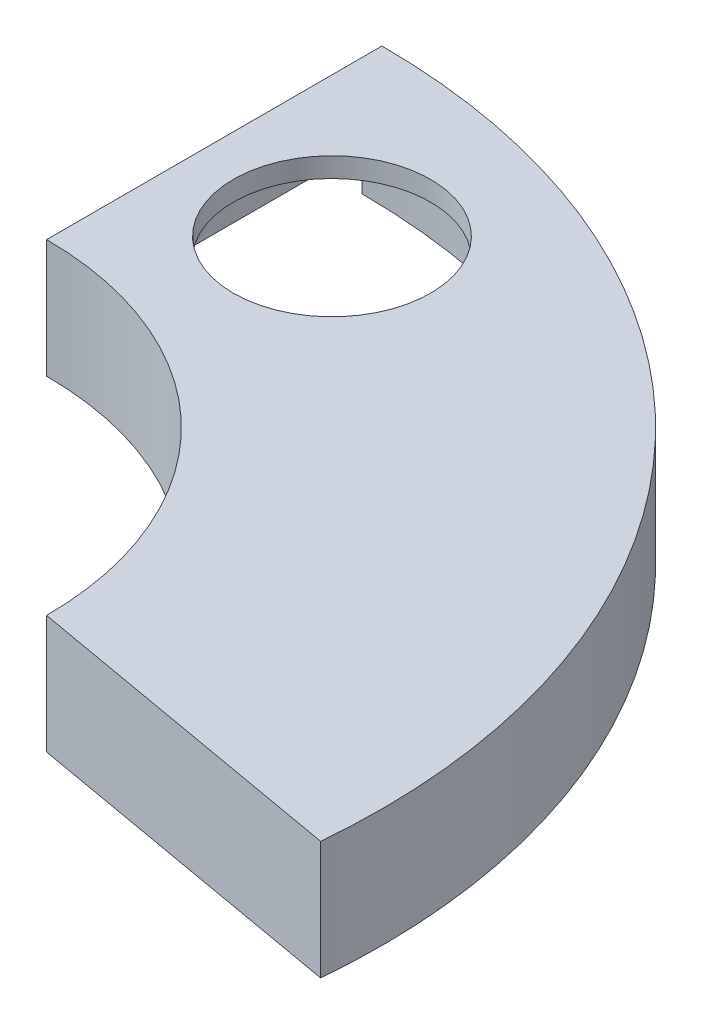
ISO-10303-21;
HEADER;
FILE_DESCRIPTION(('STEP AP214'),'2;1');
FILE_NAME('part.step','',(''),(''),'','','');
FILE_SCHEMA(('AUTOMOTIVE_DESIGN { 1 0 10303 214 1 1 1 1 }'));
ENDSEC;
DATA;
#1=APPLICATION_CONTEXT('core data for automotive mechanical design processes');
#2=APPLICATION_PROTOCOL_DEFINITION('international standard','automotive_design',2000,#1);
#3=PRODUCT_CONTEXT('',#1,'mechanical');
#4=PRODUCT('Part','Part','',(#3));
#5=PRODUCT_RELATED_PRODUCT_CATEGORY('part','',(#4));
#6=PRODUCT_DEFINITION_FORMATION('','',#4);
#7=PRODUCT_DEFINITION_CONTEXT('part definition',#1,'design');
#8=PRODUCT_DEFINITION('design','',#6,#7);
#9=PRODUCT_DEFINITION_SHAPE('','',#8);
#10=(LENGTH_UNIT() NAMED_UNIT(*) SI_UNIT(.MILLI.,.METRE.));
#11=(NAMED_UNIT(*) PLANE_ANGLE_UNIT() SI_UNIT($,.RADIAN.));
#12=(NAMED_UNIT(*) SI_UNIT($,.STERADIAN.) SOLID_ANGLE_UNIT());
#13=UNCERTAINTY_MEASURE_WITH_UNIT(LENGTH_MEASURE(1.E-05),#10,'distance_accuracy_value','');
#14=(GEOMETRIC_REPRESENTATION_CONTEXT(3) GLOBAL_UNCERTAINTY_ASSIGNED_CONTEXT((#13)) GLOBAL_UNIT_ASSIGNED_CONTEXT((#10,
#11,#12)) REPRESENTATION_CONTEXT('',''));
#15=CARTESIAN_POINT('',(0.,0.,0.));
#16=DIRECTION('',(0.,0.,1.));
#17=DIRECTION('',(1.,0.,0.));
#18=AXIS2_PLACEMENT_3D('',#15,#16,#17);
#19=CARTESIAN_POINT('',(0.,10.,-165.));
#20=DIRECTION('',(1.,0.,0.));
#21=DIRECTION('',(0.,0.,-1.));
#22=AXIS2_PLACEMENT_3D('',#19,#20,#21);
#23=PLANE('',#22);
#24=DIRECTION('',(0.,-1.,0.));
#25=VECTOR('',#24,1.);
#26=CARTESIAN_POINT('',(0.,-20.,-175.));
#27=LINE('',#26,#25);
#28=CARTESIAN_POINT('',(0.,-20.,-175.));
#29=VERTEX_POINT('',#28);
#30=CARTESIAN_POINT('',(0.,-50.,-175.));
#31=VERTEX_POINT('',#30);
#32=EDGE_CURVE('E205',#29,#31,#27,.T.);
#33=ORIENTED_EDGE('',*,*,#32,.T.);
#34=DIRECTION('',(0.,0.,-1.));
#35=VECTOR('',#34,1.);
#36=CARTESIAN_POINT('',(0.,-50.,0.));
#37=LINE('',#36,#35);
#38=CARTESIAN_POINT('',(0.,-50.,-165.));
#39=VERTEX_POINT('',#38);
#40=EDGE_CURVE('E224',#39,#31,#37,.T.);
#41=ORIENTED_EDGE('',*,*,#40,.F.);
#42=DIRECTION('',(0.,-1.,0.));
#43=VECTOR('',#42,1.);
#44=CARTESIAN_POINT('',(0.,10.,-165.));
#45=LINE('',#44,#43);
#46=CARTESIAN_POINT('',(0.,10.,-165.));
#47=VERTEX_POINT('',#46);
#48=EDGE_CURVE('E262',#47,#39,#45,.T.);
#49=ORIENTED_EDGE('',*,*,#48,.F.);
#50=DIRECTION('',(0.,0.,1.));
#51=VECTOR('',#50,1.);
#52=CARTESIAN_POINT('',(0.,10.,-165.));
#53=LINE('',#52,#51);
#54=CARTESIAN_POINT('',(0.,10.,-335.));
#55=VERTEX_POINT('',#54);
#56=EDGE_CURVE('E260',#55,#47,#53,.T.);
#57=ORIENTED_EDGE('',*,*,#56,.F.);
#58=DIRECTION('',(0.,-1.,0.));
#59=VECTOR('',#58,1.);
#60=CARTESIAN_POINT('',(0.,10.,-335.));
#61=LINE('',#60,#59);
#62=CARTESIAN_POINT('',(0.,-50.,-335.));
#63=VERTEX_POINT('',#62);
#64=EDGE_CURVE('E264',#55,#63,#61,.T.);
#65=ORIENTED_EDGE('',*,*,#64,.T.);
#66=CARTESIAN_POINT('',(0.,-50.,-325.));
#67=VERTEX_POINT('',#66);
#68=EDGE_CURVE('E204',#67,#63,#37,.T.);
#69=ORIENTED_EDGE('',*,*,#68,.F.);
#70=DIRECTION('',(0.,-1.,0.));
#71=VECTOR('',#70,1.);
#72=CARTESIAN_POINT('',(0.,-20.,-325.));
#73=LINE('',#72,#71);
#74=CARTESIAN_POINT('',(0.,-20.,-325.));
#75=VERTEX_POINT('',#74);
#76=EDGE_CURVE('E189',#75,#67,#73,.T.);
#77=ORIENTED_EDGE('',*,*,#76,.F.);
#78=DIRECTION('',(0.,0.,-1.));
#79=VECTOR('',#78,1.);
#80=CARTESIAN_POINT('',(0.,-20.,0.));
#81=LINE('',#80,#79);
#82=EDGE_CURVE('E194',#29,#75,#81,.T.);
#83=ORIENTED_EDGE('',*,*,#82,.F.);
#84=EDGE_LOOP('',(#33,#41,#49,#57,#65,#69,#77,#83));
#85=FACE_BOUND('',#84,.T.);
#86=ADVANCED_FACE('F108',(#85),#23,.F.);
#87=CARTESIAN_POINT('',(10.,-50.,0.));
#88=DIRECTION('',(1.,0.,0.));
#89=DIRECTION('',(0.,0.,-1.));
#90=AXIS2_PLACEMENT_3D('',#87,#88,#89);
#91=PLANE('',#90);
#92=DIRECTION('',(0.,1.,0.));
#93=VECTOR('',#92,1.);
#94=CARTESIAN_POINT('',(10.,-50.,-174.714052096562));
#95=LINE('',#94,#93);
#96=CARTESIAN_POINT('',(10.,-20.,-174.714052096561));
#97=VERTEX_POINT('',#96);
#98=CARTESIAN_POINT('',(10.,0.,-174.714052096562));
#99=VERTEX_POINT('',#98);
#100=EDGE_CURVE('E244',#97,#99,#95,.T.);
#101=ORIENTED_EDGE('',*,*,#100,.F.);
#102=DIRECTION('',(0.,0.,1.));
#103=VECTOR('',#102,1.);
#104=CARTESIAN_POINT('',(10.,-20.,0.));
#105=LINE('',#104,#103);
#106=CARTESIAN_POINT('',(10.,-20.,-324.846117415616));
#107=VERTEX_POINT('',#106);
#108=EDGE_CURVE('E193',#107,#97,#105,.T.);
#109=ORIENTED_EDGE('',*,*,#108,.F.);
#110=DIRECTION('',(0.,1.,0.));
#111=VECTOR('',#110,1.);
#112=CARTESIAN_POINT('',(10.,-50.,-324.846117415616));
#113=LINE('',#112,#111);
#114=CARTESIAN_POINT('',(10.,0.,-324.846117415616));
#115=VERTEX_POINT('',#114);
#116=EDGE_CURVE('E131',#107,#115,#113,.T.);
#117=ORIENTED_EDGE('',*,*,#116,.T.);
#118=DIRECTION('',(0.,0.,-1.));
#119=VECTOR('',#118,1.);
#120=CARTESIAN_POINT('',(10.,0.,0.));
#121=LINE('',#120,#119);
#122=EDGE_CURVE('E233',#99,#115,#121,.T.);
#123=ORIENTED_EDGE('',*,*,#122,.F.);
#124=EDGE_LOOP('',(#101,#109,#117,#123));
#125=FACE_BOUND('',#124,.T.);
#126=ADVANCED_FACE('F292',(#125),#91,.T.);
#127=CARTESIAN_POINT('',(0.,-50.,0.));
#128=DIRECTION('',(0.,-1.,0.));
#129=DIRECTION('',(0.,0.,-1.));
#130=AXIS2_PLACEMENT_3D('',#127,#128,#129);
#131=PLANE('',#130);
#132=ORIENTED_EDGE('',*,*,#40,.T.);
#133=CARTESIAN_POINT('',(0.,-50.,0.));
#134=DIRECTION('',(0.,-1.,0.));
#135=DIRECTION('',(0.,0.,-1.));
#136=AXIS2_PLACEMENT_3D('',#133,#134,#135);
#137=CIRCLE('',#136,175.);
#138=CARTESIAN_POINT('',(174.796994200275,-50.,-8.42679171150461));
#139=VERTEX_POINT('',#138);
#140=EDGE_CURVE('E212',#31,#139,#137,.T.);
#141=ORIENTED_EDGE('',*,*,#140,.T.);
#142=DIRECTION('',(-0.984807753012208,0.,-0.173648177666934));
#143=VECTOR('',#142,1.);
#144=CARTESIAN_POINT('',(6.71184056183211,-50.,-38.0647393544903));
#145=LINE('',#144,#143);
#146=CARTESIAN_POINT('',(324.50279725055,-50.,17.970380534887));
#147=VERTEX_POINT('',#146);
#148=EDGE_CURVE('E215',#147,#139,#145,.T.);
#149=ORIENTED_EDGE('',*,*,#148,.F.);
#150=CARTESIAN_POINT('',(0.,-50.,0.));
#151=DIRECTION('',(0.,-1.,0.));
#152=DIRECTION('',(0.,0.,-1.));
#153=AXIS2_PLACEMENT_3D('',#150,#151,#152);
#154=CIRCLE('',#153,325.);
#155=EDGE_CURVE('E123',#67,#147,#154,.T.);
#156=ORIENTED_EDGE('',*,*,#155,.F.);
#157=ORIENTED_EDGE('',*,*,#68,.T.);
#158=CARTESIAN_POINT('',(0.,-50.,0.));
#159=DIRECTION('',(0.,-1.,0.));
#160=DIRECTION('',(0.,0.,-1.));
#161=AXIS2_PLACEMENT_3D('',#158,#159,#160);
#162=CIRCLE('',#161,335.);
#163=CARTESIAN_POINT('',(333.677080988346,-50.,29.7423204053928));
#164=VERTEX_POINT('',#163);
#165=EDGE_CURVE('E227',#63,#164,#162,.T.);
#166=ORIENTED_EDGE('',*,*,#165,.T.);
#167=DIRECTION('',(-0.984807753012208,0.,-0.173648177666934));
#168=VECTOR('',#167,1.);
#169=CARTESIAN_POINT('',(4.97535878516277,-50.,-28.2166618243683));
#170=LINE('',#169,#168);
#171=CARTESIAN_POINT('',(165.,-50.,0.));
#172=VERTEX_POINT('',#171);
#173=EDGE_CURVE('E218',#164,#172,#170,.T.);
#174=ORIENTED_EDGE('',*,*,#173,.T.);
#175=CARTESIAN_POINT('',(0.,-50.,0.));
#176=DIRECTION('',(0.,-1.,0.));
#177=DIRECTION('',(0.,0.,-1.));
#178=AXIS2_PLACEMENT_3D('',#175,#176,#177);
#179=CIRCLE('',#178,165.);
#180=EDGE_CURVE('E221',#172,#39,#179,.F.);
#181=ORIENTED_EDGE('',*,*,#180,.T.);
#182=EDGE_LOOP('',(#132,#141,#149,#156,#157,#166,#174,#181));
#183=FACE_BOUND('',#182,.T.);
#184=ADVANCED_FACE('F273',(#183),#131,.T.);
#185=CARTESIAN_POINT('',(0.,0.,0.));
#186=DIRECTION('',(0.,1.,0.));
#187=DIRECTION('',(0.,0.,1.));
#188=AXIS2_PLACEMENT_3D('',#185,#186,#187);
#189=PLANE('',#188);
#190=CARTESIAN_POINT('',(70.8774350104939,0.,-238.796167172876));
#191=DIRECTION('',(0.,1.,0.));
#192=DIRECTION('',(0.,0.,1.));
#193=AXIS2_PLACEMENT_3D('',#190,#191,#192);
#194=CIRCLE('',#193,50.);
#195=CARTESIAN_POINT('',(70.8774350104939,0.,-188.796167172876));
#196=VERTEX_POINT('',#195);
#197=EDGE_CURVE('E247',#196,#196,#194,.T.);
#198=ORIENTED_EDGE('',*,*,#197,.T.);
#199=EDGE_LOOP('',(#198));
#200=FACE_BOUND('',#199,.T.);
#201=CARTESIAN_POINT('',(0.,0.,0.));
#202=DIRECTION('',(0.,-1.,0.));
#203=DIRECTION('',(0.,0.,-1.));
#204=AXIS2_PLACEMENT_3D('',#201,#202,#203);
#205=CIRCLE('',#204,175.);
#206=CARTESIAN_POINT('',(174.796994200275,0.,-8.42679171150461));
#207=VERTEX_POINT('',#206);
#208=EDGE_CURVE('E236',#99,#207,#205,.T.);
#209=ORIENTED_EDGE('',*,*,#208,.F.);
#210=ORIENTED_EDGE('',*,*,#122,.T.);
#211=CARTESIAN_POINT('',(0.,0.,0.));
#212=DIRECTION('',(0.,-1.,0.));
#213=DIRECTION('',(0.,0.,-1.));
#214=AXIS2_PLACEMENT_3D('',#211,#212,#213);
#215=CIRCLE('',#214,325.);
#216=CARTESIAN_POINT('',(324.50279725055,0.,17.970380534887));
#217=VERTEX_POINT('',#216);
#218=EDGE_CURVE('E207',#115,#217,#215,.T.);
#219=ORIENTED_EDGE('',*,*,#218,.T.);
#220=DIRECTION('',(-0.984807753012208,0.,-0.173648177666934));
#221=VECTOR('',#220,1.);
#222=CARTESIAN_POINT('',(6.71184056183211,0.,-38.0647393544903));
#223=LINE('',#222,#221);
#224=EDGE_CURVE('E213',#217,#207,#223,.T.);
#225=ORIENTED_EDGE('',*,*,#224,.T.);
#226=EDGE_LOOP('',(#209,#210,#219,#225));
#227=FACE_BOUND('',#226,.T.);
#228=ADVANCED_FACE('F290',(#200,#227),#189,.F.);
#229=CARTESIAN_POINT('',(0.,10.,0.));
#230=DIRECTION('',(0.,1.,0.));
#231=DIRECTION('',(0.,0.,1.));
#232=AXIS2_PLACEMENT_3D('',#229,#230,#231);
#233=PLANE('',#232);
#234=CARTESIAN_POINT('',(0.,10.,0.));
#235=DIRECTION('',(0.,-1.,0.));
#236=DIRECTION('',(0.,0.,1.));
#237=AXIS2_PLACEMENT_3D('',#234,#235,#236);
#238=CIRCLE('',#237,165.);
#239=CARTESIAN_POINT('',(165.,10.,0.));
#240=VERTEX_POINT('',#239);
#241=EDGE_CURVE('E251',#47,#240,#238,.T.);
#242=ORIENTED_EDGE('',*,*,#241,.T.);
#243=DIRECTION('',(0.984807753012207,0.,0.173648177666934));
#244=VECTOR('',#243,1.);
#245=CARTESIAN_POINT('',(165.,10.,0.));
#246=LINE('',#245,#244);
#247=CARTESIAN_POINT('',(333.677080988346,10.,29.7423204053928));
#248=VERTEX_POINT('',#247);
#249=EDGE_CURVE('E256',#240,#248,#246,.T.);
#250=ORIENTED_EDGE('',*,*,#249,.T.);
#251=CARTESIAN_POINT('',(0.,10.,0.));
#252=DIRECTION('',(0.,1.,0.));
#253=DIRECTION('',(0.,0.,1.));
#254=AXIS2_PLACEMENT_3D('',#251,#252,#253);
#255=CIRCLE('',#254,335.);
#256=EDGE_CURVE('E258',#248,#55,#255,.T.);
#257=ORIENTED_EDGE('',*,*,#256,.T.);
#258=ORIENTED_EDGE('',*,*,#56,.T.);
#259=EDGE_LOOP('',(#242,#250,#257,#258));
#260=FACE_BOUND('',#259,.T.);
#261=CARTESIAN_POINT('',(70.8774350104939,10.,-238.796167172876));
#262=DIRECTION('',(0.,1.,0.));
#263=DIRECTION('',(0.,0.,1.));
#264=AXIS2_PLACEMENT_3D('',#261,#262,#263);
#265=CIRCLE('',#264,50.);
#266=CARTESIAN_POINT('',(70.8774350104939,10.,-188.796167172876));
#267=VERTEX_POINT('',#266);
#268=EDGE_CURVE('E248',#267,#267,#265,.T.);
#269=ORIENTED_EDGE('',*,*,#268,.F.);
#270=EDGE_LOOP('',(#269));
#271=FACE_BOUND('',#270,.T.);
#272=ADVANCED_FACE('F311',(#260,#271),#233,.T.);
#273=CARTESIAN_POINT('',(0.,10.,0.));
#274=DIRECTION('',(0.,-1.,0.));
#275=DIRECTION('',(0.,0.,-1.));
#276=AXIS2_PLACEMENT_3D('',#273,#274,#275);
#277=CYLINDRICAL_SURFACE('',#276,165.);
#278=ORIENTED_EDGE('',*,*,#48,.T.);
#279=ORIENTED_EDGE('',*,*,#180,.F.);
#280=DIRECTION('',(0.,-1.,0.));
#281=VECTOR('',#280,1.);
#282=CARTESIAN_POINT('',(165.,10.,0.));
#283=LINE('',#282,#281);
#284=EDGE_CURVE('E12',#240,#172,#283,.T.);
#285=ORIENTED_EDGE('',*,*,#284,.F.);
#286=ORIENTED_EDGE('',*,*,#241,.F.);
#287=EDGE_LOOP('',(#278,#279,#285,#286));
#288=FACE_BOUND('',#287,.T.);
#289=ADVANCED_FACE('F110',(#288),#277,.F.);
#290=CARTESIAN_POINT('',(165.,10.,0.));
#291=DIRECTION('',(0.173648177666934,0.,-0.984807753012207));
#292=DIRECTION('',(-0.984807753012207,0.,-0.173648177666934));
#293=AXIS2_PLACEMENT_3D('',#290,#291,#292);
#294=PLANE('',#293);
#295=ORIENTED_EDGE('',*,*,#284,.T.);
#296=ORIENTED_EDGE('',*,*,#173,.F.);
#297=DIRECTION('',(0.,-1.,0.));
#298=VECTOR('',#297,1.);
#299=CARTESIAN_POINT('',(333.677080988346,10.,29.7423204053928));
#300=LINE('',#299,#298);
#301=EDGE_CURVE('E116',#248,#164,#300,.T.);
#302=ORIENTED_EDGE('',*,*,#301,.F.);
#303=ORIENTED_EDGE('',*,*,#249,.F.);
#304=EDGE_LOOP('',(#295,#296,#302,#303));
#305=FACE_BOUND('',#304,.T.);
#306=ADVANCED_FACE('F274',(#305),#294,.F.);
#307=CARTESIAN_POINT('',(0.,10.,0.));
#308=DIRECTION('',(0.,-1.,0.));
#309=DIRECTION('',(0.,0.,-1.));
#310=AXIS2_PLACEMENT_3D('',#307,#308,#309);
#311=CYLINDRICAL_SURFACE('',#310,335.);
#312=ORIENTED_EDGE('',*,*,#301,.T.);
#313=ORIENTED_EDGE('',*,*,#165,.F.);
#314=ORIENTED_EDGE('',*,*,#64,.F.);
#315=ORIENTED_EDGE('',*,*,#256,.F.);
#316=EDGE_LOOP('',(#312,#313,#314,#315));
#317=FACE_BOUND('',#316,.T.);
#318=ADVANCED_FACE('F269',(#317),#311,.T.);
#319=CARTESIAN_POINT('',(70.8774350104939,10.,-238.796167172876));
#320=DIRECTION('',(0.,-1.,0.));
#321=DIRECTION('',(0.,0.,-1.));
#322=AXIS2_PLACEMENT_3D('',#319,#320,#321);
#323=CYLINDRICAL_SURFACE('',#322,50.);
#324=ORIENTED_EDGE('',*,*,#268,.T.);
#325=EDGE_LOOP('',(#324));
#326=FACE_BOUND('',#325,.T.);
#327=ORIENTED_EDGE('',*,*,#197,.F.);
#328=EDGE_LOOP('',(#327));
#329=FACE_BOUND('',#328,.T.);
#330=ADVANCED_FACE('F307',(#326,#329),#323,.F.);
#331=CARTESIAN_POINT('',(0.,-50.,0.));
#332=DIRECTION('',(0.,1.,0.));
#333=DIRECTION('',(0.,0.,1.));
#334=AXIS2_PLACEMENT_3D('',#331,#332,#333);
#335=CYLINDRICAL_SURFACE('',#334,175.);
#336=ORIENTED_EDGE('',*,*,#208,.T.);
#337=DIRECTION('',(0.,1.,0.));
#338=VECTOR('',#337,1.);
#339=CARTESIAN_POINT('',(174.796994200275,-50.,-8.42679171150461));
#340=LINE('',#339,#338);
#341=EDGE_CURVE('E242',#139,#207,#340,.T.);
#342=ORIENTED_EDGE('',*,*,#341,.F.);
#343=ORIENTED_EDGE('',*,*,#140,.F.);
#344=ORIENTED_EDGE('',*,*,#32,.F.);
#345=CARTESIAN_POINT('',(0.,-20.,0.));
#346=DIRECTION('',(0.,-1.,0.));
#347=DIRECTION('',(0.,0.,-1.));
#348=AXIS2_PLACEMENT_3D('',#345,#346,#347);
#349=CIRCLE('',#348,175.);
#350=EDGE_CURVE('E199',#29,#97,#349,.T.);
#351=ORIENTED_EDGE('',*,*,#350,.T.);
#352=ORIENTED_EDGE('',*,*,#100,.T.);
#353=EDGE_LOOP('',(#336,#342,#343,#344,#351,#352));
#354=FACE_BOUND('',#353,.T.);
#355=ADVANCED_FACE('F283',(#354),#335,.T.);
#356=CARTESIAN_POINT('',(6.71184056183211,-50.,-38.0647393544903));
#357=DIRECTION('',(0.173648177666934,0.,-0.984807753012207));
#358=DIRECTION('',(-0.984807753012207,0.,-0.173648177666934));
#359=AXIS2_PLACEMENT_3D('',#356,#357,#358);
#360=PLANE('',#359);
#361=ORIENTED_EDGE('',*,*,#224,.F.);
#362=DIRECTION('',(0.,1.,0.));
#363=VECTOR('',#362,1.);
#364=CARTESIAN_POINT('',(324.50279725055,-50.,17.970380534887));
#365=LINE('',#364,#363);
#366=EDGE_CURVE('E230',#147,#217,#365,.T.);
#367=ORIENTED_EDGE('',*,*,#366,.F.);
#368=ORIENTED_EDGE('',*,*,#148,.T.);
#369=ORIENTED_EDGE('',*,*,#341,.T.);
#370=EDGE_LOOP('',(#361,#367,#368,#369));
#371=FACE_BOUND('',#370,.T.);
#372=ADVANCED_FACE('F287',(#371),#360,.T.);
#373=CARTESIAN_POINT('',(0.,-50.,0.));
#374=DIRECTION('',(0.,1.,0.));
#375=DIRECTION('',(0.,0.,1.));
#376=AXIS2_PLACEMENT_3D('',#373,#374,#375);
#377=CYLINDRICAL_SURFACE('',#376,325.);
#378=ORIENTED_EDGE('',*,*,#218,.F.);
#379=ORIENTED_EDGE('',*,*,#116,.F.);
#380=CARTESIAN_POINT('',(0.,-20.,0.));
#381=DIRECTION('',(0.,-1.,0.));
#382=DIRECTION('',(0.,0.,-1.));
#383=AXIS2_PLACEMENT_3D('',#380,#381,#382);
#384=CIRCLE('',#383,325.);
#385=EDGE_CURVE('E185',#75,#107,#384,.T.);
#386=ORIENTED_EDGE('',*,*,#385,.F.);
#387=ORIENTED_EDGE('',*,*,#76,.T.);
#388=ORIENTED_EDGE('',*,*,#155,.T.);
#389=ORIENTED_EDGE('',*,*,#366,.T.);
#390=EDGE_LOOP('',(#378,#379,#386,#387,#388,#389));
#391=FACE_BOUND('',#390,.T.);
#392=ADVANCED_FACE('F187',(#391),#377,.F.);
#393=CARTESIAN_POINT('',(0.,-20.,0.));
#394=DIRECTION('',(0.,-1.,0.));
#395=DIRECTION('',(0.,0.,-1.));
#396=AXIS2_PLACEMENT_3D('',#393,#394,#395);
#397=PLANE('',#396);
#398=ORIENTED_EDGE('',*,*,#82,.T.);
#399=ORIENTED_EDGE('',*,*,#385,.T.);
#400=ORIENTED_EDGE('',*,*,#108,.T.);
#401=ORIENTED_EDGE('',*,*,#350,.F.);
#402=EDGE_LOOP('',(#398,#399,#400,#401));
#403=FACE_BOUND('',#402,.T.);
#404=ADVANCED_FACE('F198',(#403),#397,.T.);
#405=CLOSED_SHELL('',(#86,#126,#184,#228,#272,#289,#306,#318,#330,#355,#372,#392,#404));
#406=MANIFOLD_SOLID_BREP('B2',#405);
#407=ADVANCED_BREP_SHAPE_REPRESENTATION('',(#18,#406),#14);
#408=SHAPE_DEFINITION_REPRESENTATION(#9,#407);
ENDSEC;
END-ISO-10303-21;
